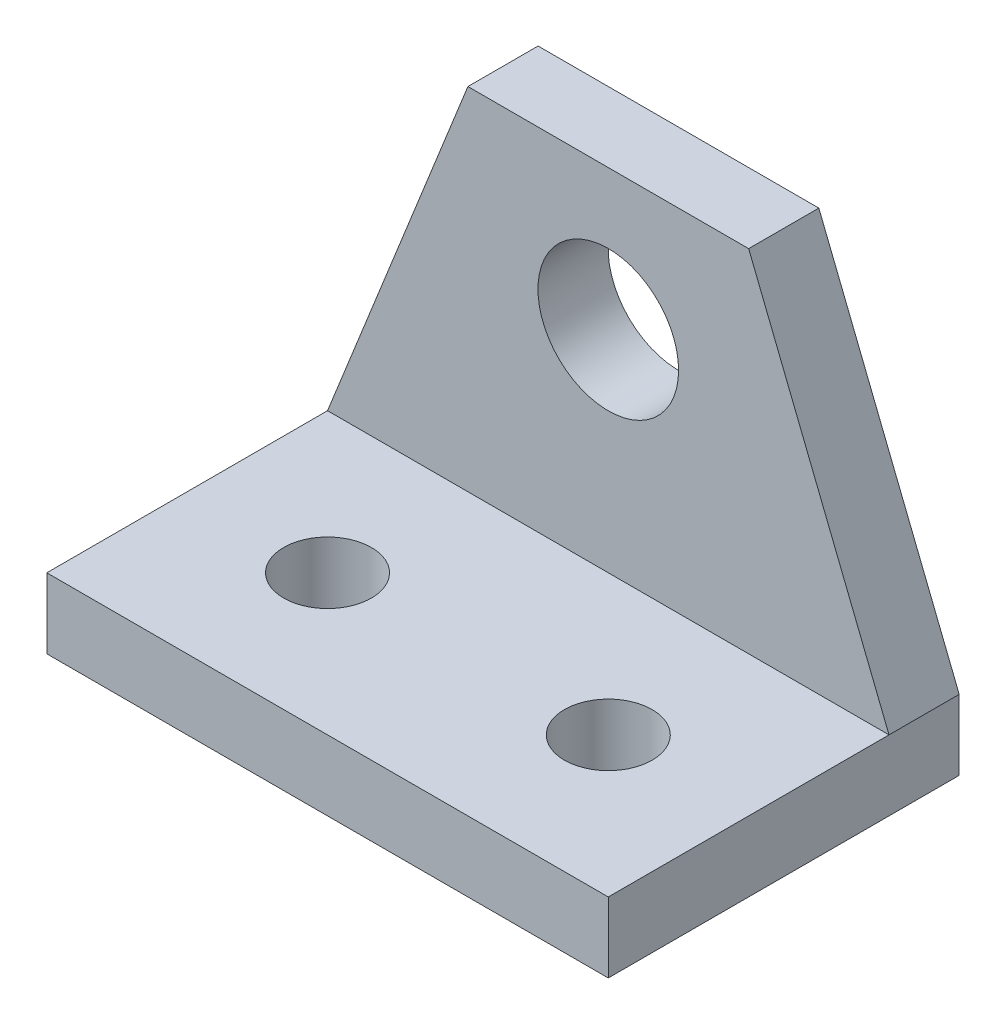
ISO-10303-21;
HEADER;
FILE_DESCRIPTION(('STEP AP214'),'2;1');
FILE_NAME('part.step','',(''),(''),'','','');
FILE_SCHEMA(('AUTOMOTIVE_DESIGN { 1 0 10303 214 1 1 1 1 }'));
ENDSEC;
DATA;
#1=APPLICATION_CONTEXT('core data for automotive mechanical design processes');
#2=APPLICATION_PROTOCOL_DEFINITION('international standard','automotive_design',2000,#1);
#3=PRODUCT_CONTEXT('',#1,'mechanical');
#4=PRODUCT('Part','Part','',(#3));
#5=PRODUCT_RELATED_PRODUCT_CATEGORY('part','',(#4));
#6=PRODUCT_DEFINITION_FORMATION('','',#4);
#7=PRODUCT_DEFINITION_CONTEXT('part definition',#1,'design');
#8=PRODUCT_DEFINITION('design','',#6,#7);
#9=PRODUCT_DEFINITION_SHAPE('','',#8);
#10=(LENGTH_UNIT() NAMED_UNIT(*) SI_UNIT(.MILLI.,.METRE.));
#11=(NAMED_UNIT(*) PLANE_ANGLE_UNIT() SI_UNIT($,.RADIAN.));
#12=(NAMED_UNIT(*) SI_UNIT($,.STERADIAN.) SOLID_ANGLE_UNIT());
#13=UNCERTAINTY_MEASURE_WITH_UNIT(LENGTH_MEASURE(1.E-05),#10,'distance_accuracy_value','');
#14=(GEOMETRIC_REPRESENTATION_CONTEXT(3) GLOBAL_UNCERTAINTY_ASSIGNED_CONTEXT((#13)) GLOBAL_UNIT_ASSIGNED_CONTEXT((#10,
#11,#12)) REPRESENTATION_CONTEXT('',''));
#15=CARTESIAN_POINT('',(0.,0.,0.));
#16=DIRECTION('',(0.,0.,1.));
#17=DIRECTION('',(1.,0.,0.));
#18=AXIS2_PLACEMENT_3D('',#15,#16,#17);
#19=CARTESIAN_POINT('',(50.8,0.,0.));
#20=DIRECTION('',(0.,1.,0.));
#21=DIRECTION('',(0.,0.,1.));
#22=AXIS2_PLACEMENT_3D('',#19,#20,#21);
#23=PLANE('',#22);
#24=CARTESIAN_POINT('',(12.7,0.,-19.05));
#25=DIRECTION('',(0.,1.,0.));
#26=DIRECTION('',(0.,0.,1.));
#27=AXIS2_PLACEMENT_3D('',#24,#25,#26);
#28=CIRCLE('',#27,3.96875000000001);
#29=CARTESIAN_POINT('',(12.7,0.,-15.08125));
#30=VERTEX_POINT('',#29);
#31=EDGE_CURVE('E180',#30,#30,#28,.F.);
#32=ORIENTED_EDGE('',*,*,#31,.F.);
#33=EDGE_LOOP('',(#32));
#34=FACE_BOUND('',#33,.T.);
#35=CARTESIAN_POINT('',(38.1,0.,-19.05));
#36=DIRECTION('',(0.,1.,0.));
#37=DIRECTION('',(0.,0.,1.));
#38=AXIS2_PLACEMENT_3D('',#35,#36,#37);
#39=CIRCLE('',#38,3.96875);
#40=CARTESIAN_POINT('',(38.1,0.,-15.08125));
#41=VERTEX_POINT('',#40);
#42=EDGE_CURVE('E146',#41,#41,#39,.F.);
#43=ORIENTED_EDGE('',*,*,#42,.F.);
#44=EDGE_LOOP('',(#43));
#45=FACE_BOUND('',#44,.T.);
#46=DIRECTION('',(0.,0.,-1.));
#47=VECTOR('',#46,1.);
#48=CARTESIAN_POINT('',(0.,0.,0.));
#49=LINE('',#48,#47);
#50=CARTESIAN_POINT('',(0.,0.,-6.35));
#51=VERTEX_POINT('',#50);
#52=CARTESIAN_POINT('',(0.,0.,-38.1));
#53=VERTEX_POINT('',#52);
#54=EDGE_CURVE('E143',#51,#53,#49,.T.);
#55=ORIENTED_EDGE('',*,*,#54,.T.);
#56=DIRECTION('',(-1.,0.,0.));
#57=VECTOR('',#56,1.);
#58=CARTESIAN_POINT('',(50.8,0.,-38.1));
#59=LINE('',#58,#57);
#60=CARTESIAN_POINT('',(50.8,0.,-38.1));
#61=VERTEX_POINT('',#60);
#62=EDGE_CURVE('E13',#61,#53,#59,.T.);
#63=ORIENTED_EDGE('',*,*,#62,.F.);
#64=DIRECTION('',(0.,0.,-1.));
#65=VECTOR('',#64,1.);
#66=CARTESIAN_POINT('',(50.8,0.,0.));
#67=LINE('',#66,#65);
#68=CARTESIAN_POINT('',(50.8,0.,-6.35));
#69=VERTEX_POINT('',#68);
#70=EDGE_CURVE('E131',#69,#61,#67,.T.);
#71=ORIENTED_EDGE('',*,*,#70,.F.);
#72=DIRECTION('',(-1.,0.,0.));
#73=VECTOR('',#72,1.);
#74=CARTESIAN_POINT('',(50.8,0.,-6.35));
#75=LINE('',#74,#73);
#76=EDGE_CURVE('E70',#69,#51,#75,.T.);
#77=ORIENTED_EDGE('',*,*,#76,.T.);
#78=EDGE_LOOP('',(#55,#63,#71,#77));
#79=FACE_BOUND('',#78,.T.);
#80=ADVANCED_FACE('F47',(#34,#45,#79),#23,.F.);
#81=CARTESIAN_POINT('',(50.8,0.,-38.1));
#82=DIRECTION('',(0.,0.,1.));
#83=DIRECTION('',(1.,0.,0.));
#84=AXIS2_PLACEMENT_3D('',#81,#82,#83);
#85=PLANE('',#84);
#86=CARTESIAN_POINT('',(25.4,25.4,-38.1));
#87=DIRECTION('',(0.,0.,1.));
#88=DIRECTION('',(1.,0.,0.));
#89=AXIS2_PLACEMENT_3D('',#86,#87,#88);
#90=CIRCLE('',#89,6.3627);
#91=CARTESIAN_POINT('',(31.7627,25.4,-38.1));
#92=VERTEX_POINT('',#91);
#93=EDGE_CURVE('E127',#92,#92,#90,.F.);
#94=ORIENTED_EDGE('',*,*,#93,.F.);
#95=EDGE_LOOP('',(#94));
#96=FACE_BOUND('',#95,.T.);
#97=DIRECTION('',(-1.,0.,0.));
#98=VECTOR('',#97,1.);
#99=CARTESIAN_POINT('',(50.8,38.1,-38.1));
#100=LINE('',#99,#98);
#101=CARTESIAN_POINT('',(38.1,38.1,-38.1));
#102=VERTEX_POINT('',#101);
#103=CARTESIAN_POINT('',(12.7,38.1,-38.1));
#104=VERTEX_POINT('',#103);
#105=EDGE_CURVE('E54',#102,#104,#100,.T.);
#106=ORIENTED_EDGE('',*,*,#105,.F.);
#107=DIRECTION('',(-0.371390676354104,0.928476690885259,0.));
#108=VECTOR('',#107,1.);
#109=CARTESIAN_POINT('',(38.1,38.1,-38.1));
#110=LINE('',#109,#108);
#111=CARTESIAN_POINT('',(50.8,6.35,-38.1));
#112=VERTEX_POINT('',#111);
#113=EDGE_CURVE('E116',#112,#102,#110,.T.);
#114=ORIENTED_EDGE('',*,*,#113,.F.);
#115=DIRECTION('',(0.,1.,0.));
#116=VECTOR('',#115,1.);
#117=CARTESIAN_POINT('',(50.8,0.,-38.1));
#118=LINE('',#117,#116);
#119=EDGE_CURVE('E93',#61,#112,#118,.T.);
#120=ORIENTED_EDGE('',*,*,#119,.F.);
#121=ORIENTED_EDGE('',*,*,#62,.T.);
#122=DIRECTION('',(0.,1.,0.));
#123=VECTOR('',#122,1.);
#124=CARTESIAN_POINT('',(0.,0.,-38.1));
#125=LINE('',#124,#123);
#126=CARTESIAN_POINT('',(0.,6.35,-38.1));
#127=VERTEX_POINT('',#126);
#128=EDGE_CURVE('E145',#53,#127,#125,.T.);
#129=ORIENTED_EDGE('',*,*,#128,.T.);
#130=DIRECTION('',(-0.371390676354104,-0.928476690885259,0.));
#131=VECTOR('',#130,1.);
#132=CARTESIAN_POINT('',(12.7,38.1,-38.1));
#133=LINE('',#132,#131);
#134=EDGE_CURVE('E61',#104,#127,#133,.T.);
#135=ORIENTED_EDGE('',*,*,#134,.F.);
#136=EDGE_LOOP('',(#106,#114,#120,#121,#129,#135));
#137=FACE_BOUND('',#136,.T.);
#138=ADVANCED_FACE('F126',(#96,#137),#85,.F.);
#139=CARTESIAN_POINT('',(50.8,38.1,0.));
#140=DIRECTION('',(0.,-1.,0.));
#141=DIRECTION('',(0.,0.,-1.));
#142=AXIS2_PLACEMENT_3D('',#139,#140,#141);
#143=PLANE('',#142);
#144=DIRECTION('',(-1.,0.,0.));
#145=VECTOR('',#144,1.);
#146=CARTESIAN_POINT('',(50.8,38.1,-31.75));
#147=LINE('',#146,#145);
#148=CARTESIAN_POINT('',(38.1,38.1,-31.75));
#149=VERTEX_POINT('',#148);
#150=CARTESIAN_POINT('',(12.7,38.1,-31.75));
#151=VERTEX_POINT('',#150);
#152=EDGE_CURVE('E160',#149,#151,#147,.T.);
#153=ORIENTED_EDGE('',*,*,#152,.F.);
#154=DIRECTION('',(0.,0.,1.));
#155=VECTOR('',#154,1.);
#156=CARTESIAN_POINT('',(38.1,38.1,-38.101));
#157=LINE('',#156,#155);
#158=EDGE_CURVE('E123',#102,#149,#157,.T.);
#159=ORIENTED_EDGE('',*,*,#158,.F.);
#160=ORIENTED_EDGE('',*,*,#105,.T.);
#161=DIRECTION('',(0.,0.,1.));
#162=VECTOR('',#161,1.);
#163=CARTESIAN_POINT('',(12.7,38.1,-38.101));
#164=LINE('',#163,#162);
#165=EDGE_CURVE('E165',#104,#151,#164,.T.);
#166=ORIENTED_EDGE('',*,*,#165,.T.);
#167=EDGE_LOOP('',(#153,#159,#160,#166));
#168=FACE_BOUND('',#167,.T.);
#169=ADVANCED_FACE('F164',(#168),#143,.F.);
#170=CARTESIAN_POINT('',(50.8,0.,-31.75));
#171=DIRECTION('',(0.,0.,1.));
#172=DIRECTION('',(1.,0.,0.));
#173=AXIS2_PLACEMENT_3D('',#170,#171,#172);
#174=PLANE('',#173);
#175=CARTESIAN_POINT('',(25.4,25.4,-31.75));
#176=DIRECTION('',(0.,0.,1.));
#177=DIRECTION('',(1.,0.,0.));
#178=AXIS2_PLACEMENT_3D('',#175,#176,#177);
#179=CIRCLE('',#178,6.3627);
#180=CARTESIAN_POINT('',(31.7627,25.4,-31.75));
#181=VERTEX_POINT('',#180);
#182=EDGE_CURVE('E204',#181,#181,#179,.T.);
#183=ORIENTED_EDGE('',*,*,#182,.F.);
#184=EDGE_LOOP('',(#183));
#185=FACE_BOUND('',#184,.T.);
#186=DIRECTION('',(0.371390676354104,-0.928476690885259,0.));
#187=VECTOR('',#186,1.);
#188=CARTESIAN_POINT('',(38.1,38.1,-31.75));
#189=LINE('',#188,#187);
#190=CARTESIAN_POINT('',(50.8,6.35,-31.75));
#191=VERTEX_POINT('',#190);
#192=EDGE_CURVE('E119',#149,#191,#189,.T.);
#193=ORIENTED_EDGE('',*,*,#192,.F.);
#194=ORIENTED_EDGE('',*,*,#152,.T.);
#195=DIRECTION('',(0.371390676354104,0.928476690885259,0.));
#196=VECTOR('',#195,1.);
#197=CARTESIAN_POINT('',(12.7,38.1,-31.75));
#198=LINE('',#197,#196);
#199=CARTESIAN_POINT('',(0.,6.35,-31.75));
#200=VERTEX_POINT('',#199);
#201=EDGE_CURVE('E169',#200,#151,#198,.T.);
#202=ORIENTED_EDGE('',*,*,#201,.F.);
#203=DIRECTION('',(-1.,0.,0.));
#204=VECTOR('',#203,1.);
#205=CARTESIAN_POINT('',(50.8,6.35,-31.75));
#206=LINE('',#205,#204);
#207=EDGE_CURVE('E157',#191,#200,#206,.T.);
#208=ORIENTED_EDGE('',*,*,#207,.F.);
#209=EDGE_LOOP('',(#193,#194,#202,#208));
#210=FACE_BOUND('',#209,.T.);
#211=ADVANCED_FACE('F199',(#185,#210),#174,.T.);
#212=CARTESIAN_POINT('',(50.8,6.35,0.));
#213=DIRECTION('',(0.,1.,0.));
#214=DIRECTION('',(0.,0.,1.));
#215=AXIS2_PLACEMENT_3D('',#212,#213,#214);
#216=PLANE('',#215);
#217=CARTESIAN_POINT('',(12.7,6.35,-19.05));
#218=DIRECTION('',(0.,1.,0.));
#219=DIRECTION('',(0.,0.,1.));
#220=AXIS2_PLACEMENT_3D('',#217,#218,#219);
#221=CIRCLE('',#220,3.96875000000001);
#222=CARTESIAN_POINT('',(12.7,6.35,-15.08125));
#223=VERTEX_POINT('',#222);
#224=EDGE_CURVE('E170',#223,#223,#221,.T.);
#225=ORIENTED_EDGE('',*,*,#224,.F.);
#226=EDGE_LOOP('',(#225));
#227=FACE_BOUND('',#226,.T.);
#228=CARTESIAN_POINT('',(38.1,6.35,-19.05));
#229=DIRECTION('',(0.,1.,0.));
#230=DIRECTION('',(0.,0.,1.));
#231=AXIS2_PLACEMENT_3D('',#228,#229,#230);
#232=CIRCLE('',#231,3.96875);
#233=CARTESIAN_POINT('',(38.1,6.35,-15.08125));
#234=VERTEX_POINT('',#233);
#235=EDGE_CURVE('E183',#234,#234,#232,.T.);
#236=ORIENTED_EDGE('',*,*,#235,.F.);
#237=EDGE_LOOP('',(#236));
#238=FACE_BOUND('',#237,.T.);
#239=DIRECTION('',(0.,0.,-1.));
#240=VECTOR('',#239,1.);
#241=CARTESIAN_POINT('',(0.,6.35,0.));
#242=LINE('',#241,#240);
#243=CARTESIAN_POINT('',(0.,6.35,-6.35));
#244=VERTEX_POINT('',#243);
#245=EDGE_CURVE('E149',#244,#200,#242,.T.);
#246=ORIENTED_EDGE('',*,*,#245,.F.);
#247=DIRECTION('',(-1.,0.,0.));
#248=VECTOR('',#247,1.);
#249=CARTESIAN_POINT('',(50.8,6.35,-6.35));
#250=LINE('',#249,#248);
#251=CARTESIAN_POINT('',(50.8,6.35,-6.35));
#252=VERTEX_POINT('',#251);
#253=EDGE_CURVE('E155',#252,#244,#250,.T.);
#254=ORIENTED_EDGE('',*,*,#253,.F.);
#255=DIRECTION('',(0.,0.,-1.));
#256=VECTOR('',#255,1.);
#257=CARTESIAN_POINT('',(50.8,6.35,0.));
#258=LINE('',#257,#256);
#259=EDGE_CURVE('E133',#252,#191,#258,.T.);
#260=ORIENTED_EDGE('',*,*,#259,.T.);
#261=ORIENTED_EDGE('',*,*,#207,.T.);
#262=EDGE_LOOP('',(#246,#254,#260,#261));
#263=FACE_BOUND('',#262,.T.);
#264=ADVANCED_FACE('F197',(#227,#238,#263),#216,.T.);
#265=CARTESIAN_POINT('',(50.8,0.,-6.35));
#266=DIRECTION('',(0.,0.,1.));
#267=DIRECTION('',(1.,0.,0.));
#268=AXIS2_PLACEMENT_3D('',#265,#266,#267);
#269=PLANE('',#268);
#270=DIRECTION('',(0.,1.,0.));
#271=VECTOR('',#270,1.);
#272=CARTESIAN_POINT('',(0.,0.,-6.35));
#273=LINE('',#272,#271);
#274=EDGE_CURVE('E138',#51,#244,#273,.T.);
#275=ORIENTED_EDGE('',*,*,#274,.F.);
#276=ORIENTED_EDGE('',*,*,#76,.F.);
#277=DIRECTION('',(0.,1.,0.));
#278=VECTOR('',#277,1.);
#279=CARTESIAN_POINT('',(50.8,0.,-6.35));
#280=LINE('',#279,#278);
#281=EDGE_CURVE('E136',#69,#252,#280,.T.);
#282=ORIENTED_EDGE('',*,*,#281,.T.);
#283=ORIENTED_EDGE('',*,*,#253,.T.);
#284=EDGE_LOOP('',(#275,#276,#282,#283));
#285=FACE_BOUND('',#284,.T.);
#286=ADVANCED_FACE('F194',(#285),#269,.T.);
#287=CARTESIAN_POINT('',(50.8,0.,0.));
#288=DIRECTION('',(1.,0.,0.));
#289=DIRECTION('',(0.,0.,-1.));
#290=AXIS2_PLACEMENT_3D('',#287,#288,#289);
#291=PLANE('',#290);
#292=DIRECTION('',(0.,0.,1.));
#293=VECTOR('',#292,1.);
#294=CARTESIAN_POINT('',(50.8,6.35,-38.101));
#295=LINE('',#294,#293);
#296=EDGE_CURVE('E114',#112,#191,#295,.T.);
#297=ORIENTED_EDGE('',*,*,#296,.T.);
#298=ORIENTED_EDGE('',*,*,#259,.F.);
#299=ORIENTED_EDGE('',*,*,#281,.F.);
#300=ORIENTED_EDGE('',*,*,#70,.T.);
#301=ORIENTED_EDGE('',*,*,#119,.T.);
#302=EDGE_LOOP('',(#297,#298,#299,#300,#301));
#303=FACE_BOUND('',#302,.T.);
#304=ADVANCED_FACE('F129',(#303),#291,.T.);
#305=CARTESIAN_POINT('',(0.,0.,0.));
#306=DIRECTION('',(1.,0.,0.));
#307=DIRECTION('',(0.,0.,-1.));
#308=AXIS2_PLACEMENT_3D('',#305,#306,#307);
#309=PLANE('',#308);
#310=ORIENTED_EDGE('',*,*,#245,.T.);
#311=DIRECTION('',(0.,0.,1.));
#312=VECTOR('',#311,1.);
#313=CARTESIAN_POINT('',(0.,6.35,-38.101));
#314=LINE('',#313,#312);
#315=EDGE_CURVE('E171',#127,#200,#314,.T.);
#316=ORIENTED_EDGE('',*,*,#315,.F.);
#317=ORIENTED_EDGE('',*,*,#128,.F.);
#318=ORIENTED_EDGE('',*,*,#54,.F.);
#319=ORIENTED_EDGE('',*,*,#274,.T.);
#320=EDGE_LOOP('',(#310,#316,#317,#318,#319));
#321=FACE_BOUND('',#320,.T.);
#322=ADVANCED_FACE('F193',(#321),#309,.F.);
#323=CARTESIAN_POINT('',(38.1,-0.00100000000000013,-19.05));
#324=DIRECTION('',(0.,1.,0.));
#325=DIRECTION('',(0.,0.,1.));
#326=AXIS2_PLACEMENT_3D('',#323,#324,#325);
#327=CYLINDRICAL_SURFACE('',#326,3.96875);
#328=ORIENTED_EDGE('',*,*,#235,.T.);
#329=EDGE_LOOP('',(#328));
#330=FACE_BOUND('',#329,.T.);
#331=ORIENTED_EDGE('',*,*,#42,.T.);
#332=EDGE_LOOP('',(#331));
#333=FACE_BOUND('',#332,.T.);
#334=ADVANCED_FACE('F188',(#330,#333),#327,.F.);
#335=CARTESIAN_POINT('',(12.7,-0.00100000000000013,-19.05));
#336=DIRECTION('',(0.,1.,0.));
#337=DIRECTION('',(0.,0.,1.));
#338=AXIS2_PLACEMENT_3D('',#335,#336,#337);
#339=CYLINDRICAL_SURFACE('',#338,3.96875000000001);
#340=ORIENTED_EDGE('',*,*,#224,.T.);
#341=EDGE_LOOP('',(#340));
#342=FACE_BOUND('',#341,.T.);
#343=ORIENTED_EDGE('',*,*,#31,.T.);
#344=EDGE_LOOP('',(#343));
#345=FACE_BOUND('',#344,.T.);
#346=ADVANCED_FACE('F235',(#342,#345),#339,.F.);
#347=CARTESIAN_POINT('',(12.7,38.1,-38.101));
#348=DIRECTION('',(0.928476690885259,-0.371390676354104,0.));
#349=DIRECTION('',(0.371390676354104,0.928476690885259,0.));
#350=AXIS2_PLACEMENT_3D('',#347,#348,#349);
#351=PLANE('',#350);
#352=ORIENTED_EDGE('',*,*,#134,.T.);
#353=ORIENTED_EDGE('',*,*,#315,.T.);
#354=ORIENTED_EDGE('',*,*,#201,.T.);
#355=ORIENTED_EDGE('',*,*,#165,.F.);
#356=EDGE_LOOP('',(#352,#353,#354,#355));
#357=FACE_BOUND('',#356,.T.);
#358=ADVANCED_FACE('F167',(#357),#351,.F.);
#359=CARTESIAN_POINT('',(38.1,38.1,-38.101));
#360=DIRECTION('',(-0.928476690885259,-0.371390676354104,0.));
#361=DIRECTION('',(0.371390676354104,-0.928476690885259,0.));
#362=AXIS2_PLACEMENT_3D('',#359,#360,#361);
#363=PLANE('',#362);
#364=ORIENTED_EDGE('',*,*,#113,.T.);
#365=ORIENTED_EDGE('',*,*,#158,.T.);
#366=ORIENTED_EDGE('',*,*,#192,.T.);
#367=ORIENTED_EDGE('',*,*,#296,.F.);
#368=EDGE_LOOP('',(#364,#365,#366,#367));
#369=FACE_BOUND('',#368,.T.);
#370=ADVANCED_FACE('F115',(#369),#363,.F.);
#371=CARTESIAN_POINT('',(25.4,25.4,-38.101));
#372=DIRECTION('',(0.,0.,1.));
#373=DIRECTION('',(1.,0.,0.));
#374=AXIS2_PLACEMENT_3D('',#371,#372,#373);
#375=CYLINDRICAL_SURFACE('',#374,6.3627);
#376=ORIENTED_EDGE('',*,*,#182,.T.);
#377=EDGE_LOOP('',(#376));
#378=FACE_BOUND('',#377,.T.);
#379=ORIENTED_EDGE('',*,*,#93,.T.);
#380=EDGE_LOOP('',(#379));
#381=FACE_BOUND('',#380,.T.);
#382=ADVANCED_FACE('F208',(#378,#381),#375,.F.);
#383=CLOSED_SHELL('',(#80,#138,#169,#211,#264,#286,#304,#322,#334,#346,#358,#370,#382));
#384=MANIFOLD_SOLID_BREP('B2',#383);
#385=ADVANCED_BREP_SHAPE_REPRESENTATION('',(#18,#384),#14);
#386=SHAPE_DEFINITION_REPRESENTATION(#9,#385);
ENDSEC;
END-ISO-10303-21;
